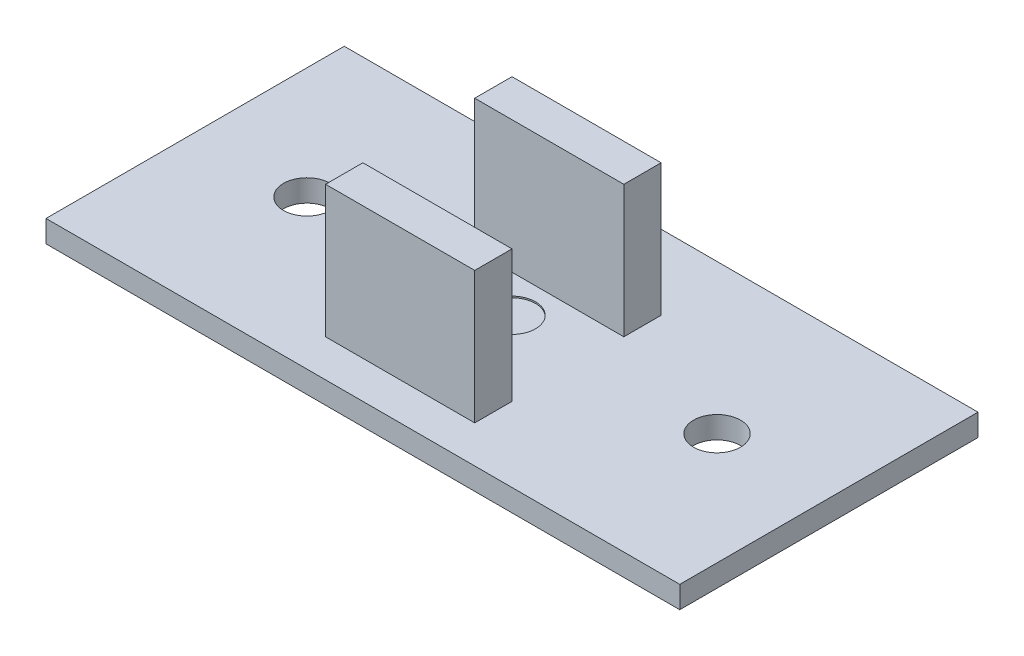
ISO-10303-21;
HEADER;
FILE_DESCRIPTION(('STEP AP214'),'2;1');
FILE_NAME('part.step','',(''),(''),'','','');
FILE_SCHEMA(('AUTOMOTIVE_DESIGN { 1 0 10303 214 1 1 1 1 }'));
ENDSEC;
DATA;
#1=APPLICATION_CONTEXT('core data for automotive mechanical design processes');
#2=APPLICATION_PROTOCOL_DEFINITION('international standard','automotive_design',2000,#1);
#3=PRODUCT_CONTEXT('',#1,'mechanical');
#4=PRODUCT('Part','Part','',(#3));
#5=PRODUCT_RELATED_PRODUCT_CATEGORY('part','',(#4));
#6=PRODUCT_DEFINITION_FORMATION('','',#4);
#7=PRODUCT_DEFINITION_CONTEXT('part definition',#1,'design');
#8=PRODUCT_DEFINITION('design','',#6,#7);
#9=PRODUCT_DEFINITION_SHAPE('','',#8);
#10=(LENGTH_UNIT() NAMED_UNIT(*) SI_UNIT(.MILLI.,.METRE.));
#11=(NAMED_UNIT(*) PLANE_ANGLE_UNIT() SI_UNIT($,.RADIAN.));
#12=(NAMED_UNIT(*) SI_UNIT($,.STERADIAN.) SOLID_ANGLE_UNIT());
#13=UNCERTAINTY_MEASURE_WITH_UNIT(LENGTH_MEASURE(1.E-05),#10,'distance_accuracy_value','');
#14=(GEOMETRIC_REPRESENTATION_CONTEXT(3) GLOBAL_UNCERTAINTY_ASSIGNED_CONTEXT((#13)) GLOBAL_UNIT_ASSIGNED_CONTEXT((#10,
#11,#12)) REPRESENTATION_CONTEXT('',''));
#15=CARTESIAN_POINT('',(0.,0.,0.));
#16=DIRECTION('',(0.,0.,1.));
#17=DIRECTION('',(1.,0.,0.));
#18=AXIS2_PLACEMENT_3D('',#15,#16,#17);
#19=CARTESIAN_POINT('',(16.51,10.5,-15.24));
#20=DIRECTION('',(0.,0.,1.));
#21=DIRECTION('',(1.,0.,0.));
#22=AXIS2_PLACEMENT_3D('',#19,#20,#21);
#23=PLANE('',#22);
#24=DIRECTION('',(-1.,0.,0.));
#25=VECTOR('',#24,1.);
#26=CARTESIAN_POINT('',(16.51,1.5,-15.24));
#27=LINE('',#26,#25);
#28=CARTESIAN_POINT('',(26.67,1.5,-15.24));
#29=VERTEX_POINT('',#28);
#30=CARTESIAN_POINT('',(16.51,1.5,-15.24));
#31=VERTEX_POINT('',#30);
#32=EDGE_CURVE('E118',#29,#31,#27,.T.);
#33=ORIENTED_EDGE('',*,*,#32,.T.);
#34=DIRECTION('',(0.,-1.,0.));
#35=VECTOR('',#34,1.);
#36=CARTESIAN_POINT('',(16.51,10.5,-15.24));
#37=LINE('',#36,#35);
#38=CARTESIAN_POINT('',(16.51,10.5,-15.24));
#39=VERTEX_POINT('',#38);
#40=EDGE_CURVE('E12',#39,#31,#37,.T.);
#41=ORIENTED_EDGE('',*,*,#40,.F.);
#42=DIRECTION('',(-1.,0.,0.));
#43=VECTOR('',#42,1.);
#44=CARTESIAN_POINT('',(16.51,10.5,-15.24));
#45=LINE('',#44,#43);
#46=CARTESIAN_POINT('',(26.67,10.5,-15.24));
#47=VERTEX_POINT('',#46);
#48=EDGE_CURVE('E106',#47,#39,#45,.T.);
#49=ORIENTED_EDGE('',*,*,#48,.F.);
#50=DIRECTION('',(0.,-1.,0.));
#51=VECTOR('',#50,1.);
#52=CARTESIAN_POINT('',(26.67,10.5,-15.24));
#53=LINE('',#52,#51);
#54=EDGE_CURVE('E114',#47,#29,#53,.T.);
#55=ORIENTED_EDGE('',*,*,#54,.T.);
#56=EDGE_LOOP('',(#33,#41,#49,#55));
#57=FACE_BOUND('',#56,.T.);
#58=ADVANCED_FACE('F55',(#57),#23,.F.);
#59=CARTESIAN_POINT('',(16.51,10.5,-15.24));
#60=DIRECTION('',(1.,0.,0.));
#61=DIRECTION('',(0.,0.,-1.));
#62=AXIS2_PLACEMENT_3D('',#59,#60,#61);
#63=PLANE('',#62);
#64=DIRECTION('',(0.,0.,1.));
#65=VECTOR('',#64,1.);
#66=CARTESIAN_POINT('',(16.51,1.5,-15.24));
#67=LINE('',#66,#65);
#68=CARTESIAN_POINT('',(16.51,1.5,-12.7));
#69=VERTEX_POINT('',#68);
#70=EDGE_CURVE('E110',#31,#69,#67,.T.);
#71=ORIENTED_EDGE('',*,*,#70,.T.);
#72=DIRECTION('',(0.,-1.,0.));
#73=VECTOR('',#72,1.);
#74=CARTESIAN_POINT('',(16.51,10.5,-12.7));
#75=LINE('',#74,#73);
#76=CARTESIAN_POINT('',(16.51,10.5,-12.7));
#77=VERTEX_POINT('',#76);
#78=EDGE_CURVE('E63',#77,#69,#75,.T.);
#79=ORIENTED_EDGE('',*,*,#78,.F.);
#80=DIRECTION('',(0.,0.,1.));
#81=VECTOR('',#80,1.);
#82=CARTESIAN_POINT('',(16.51,10.5,-15.24));
#83=LINE('',#82,#81);
#84=EDGE_CURVE('E101',#39,#77,#83,.T.);
#85=ORIENTED_EDGE('',*,*,#84,.F.);
#86=ORIENTED_EDGE('',*,*,#40,.T.);
#87=EDGE_LOOP('',(#71,#79,#85,#86));
#88=FACE_BOUND('',#87,.T.);
#89=ADVANCED_FACE('F109',(#88),#63,.F.);
#90=CARTESIAN_POINT('',(16.51,10.5,-12.7));
#91=DIRECTION('',(0.,0.,-1.));
#92=DIRECTION('',(-1.,0.,0.));
#93=AXIS2_PLACEMENT_3D('',#90,#91,#92);
#94=PLANE('',#93);
#95=DIRECTION('',(1.,0.,0.));
#96=VECTOR('',#95,1.);
#97=CARTESIAN_POINT('',(16.51,1.5,-12.7));
#98=LINE('',#97,#96);
#99=CARTESIAN_POINT('',(26.67,1.5,-12.7));
#100=VERTEX_POINT('',#99);
#101=EDGE_CURVE('E88',#69,#100,#98,.T.);
#102=ORIENTED_EDGE('',*,*,#101,.T.);
#103=DIRECTION('',(0.,-1.,0.));
#104=VECTOR('',#103,1.);
#105=CARTESIAN_POINT('',(26.67,10.5,-12.7));
#106=LINE('',#105,#104);
#107=CARTESIAN_POINT('',(26.67,10.5,-12.7));
#108=VERTEX_POINT('',#107);
#109=EDGE_CURVE('E111',#108,#100,#106,.T.);
#110=ORIENTED_EDGE('',*,*,#109,.F.);
#111=DIRECTION('',(1.,0.,0.));
#112=VECTOR('',#111,1.);
#113=CARTESIAN_POINT('',(16.51,10.5,-12.7));
#114=LINE('',#113,#112);
#115=EDGE_CURVE('E104',#77,#108,#114,.T.);
#116=ORIENTED_EDGE('',*,*,#115,.F.);
#117=ORIENTED_EDGE('',*,*,#78,.T.);
#118=EDGE_LOOP('',(#102,#110,#116,#117));
#119=FACE_BOUND('',#118,.T.);
#120=ADVANCED_FACE('F112',(#119),#94,.F.);
#121=CARTESIAN_POINT('',(26.67,10.5,-15.24));
#122=DIRECTION('',(-1.,0.,0.));
#123=DIRECTION('',(0.,0.,1.));
#124=AXIS2_PLACEMENT_3D('',#121,#122,#123);
#125=PLANE('',#124);
#126=DIRECTION('',(0.,0.,-1.));
#127=VECTOR('',#126,1.);
#128=CARTESIAN_POINT('',(26.67,1.5,-15.24));
#129=LINE('',#128,#127);
#130=EDGE_CURVE('E94',#100,#29,#129,.T.);
#131=ORIENTED_EDGE('',*,*,#130,.T.);
#132=ORIENTED_EDGE('',*,*,#54,.F.);
#133=DIRECTION('',(0.,0.,-1.));
#134=VECTOR('',#133,1.);
#135=CARTESIAN_POINT('',(26.67,10.5,-15.24));
#136=LINE('',#135,#134);
#137=EDGE_CURVE('E71',#108,#47,#136,.T.);
#138=ORIENTED_EDGE('',*,*,#137,.F.);
#139=ORIENTED_EDGE('',*,*,#109,.T.);
#140=EDGE_LOOP('',(#131,#132,#138,#139));
#141=FACE_BOUND('',#140,.T.);
#142=ADVANCED_FACE('F125',(#141),#125,.F.);
#143=CARTESIAN_POINT('',(0.,10.5,0.));
#144=DIRECTION('',(0.,-1.,0.));
#145=DIRECTION('',(0.,0.,-1.));
#146=AXIS2_PLACEMENT_3D('',#143,#144,#145);
#147=PLANE('',#146);
#148=ORIENTED_EDGE('',*,*,#48,.T.);
#149=ORIENTED_EDGE('',*,*,#84,.T.);
#150=ORIENTED_EDGE('',*,*,#115,.T.);
#151=ORIENTED_EDGE('',*,*,#137,.T.);
#152=EDGE_LOOP('',(#148,#149,#150,#151));
#153=FACE_BOUND('',#152,.T.);
#154=ADVANCED_FACE('F102',(#153),#147,.F.);
#155=CARTESIAN_POINT('',(0.,1.5,0.));
#156=DIRECTION('',(0.,-1.,0.));
#157=DIRECTION('',(0.,0.,-1.));
#158=AXIS2_PLACEMENT_3D('',#155,#156,#157);
#159=PLANE('',#158);
#160=ORIENTED_EDGE('',*,*,#32,.F.);
#161=ORIENTED_EDGE('',*,*,#130,.F.);
#162=ORIENTED_EDGE('',*,*,#101,.F.);
#163=ORIENTED_EDGE('',*,*,#70,.F.);
#164=EDGE_LOOP('',(#160,#161,#162,#163));
#165=FACE_BOUND('',#164,.T.);
#166=ADVANCED_FACE('F128',(#165),#159,.T.);
#167=CLOSED_SHELL('',(#58,#89,#120,#142,#154,#166));
#168=MANIFOLD_SOLID_BREP('B2',#167);
#169=CARTESIAN_POINT('',(16.51,10.5,-5.08));
#170=DIRECTION('',(1.,0.,0.));
#171=DIRECTION('',(0.,0.,-1.));
#172=AXIS2_PLACEMENT_3D('',#169,#170,#171);
#173=PLANE('',#172);
#174=DIRECTION('',(0.,0.,1.));
#175=VECTOR('',#174,1.);
#176=CARTESIAN_POINT('',(16.51,1.5,-5.08));
#177=LINE('',#176,#175);
#178=CARTESIAN_POINT('',(16.51,1.5,-5.08));
#179=VERTEX_POINT('',#178);
#180=CARTESIAN_POINT('',(16.51,1.5,-2.54));
#181=VERTEX_POINT('',#180);
#182=EDGE_CURVE('E250',#179,#181,#177,.T.);
#183=ORIENTED_EDGE('',*,*,#182,.T.);
#184=DIRECTION('',(0.,-1.,0.));
#185=VECTOR('',#184,1.);
#186=CARTESIAN_POINT('',(16.51,10.5,-2.54));
#187=LINE('',#186,#185);
#188=CARTESIAN_POINT('',(16.51,10.5,-2.54));
#189=VERTEX_POINT('',#188);
#190=EDGE_CURVE('E53',#189,#181,#187,.T.);
#191=ORIENTED_EDGE('',*,*,#190,.F.);
#192=DIRECTION('',(0.,0.,1.));
#193=VECTOR('',#192,1.);
#194=CARTESIAN_POINT('',(16.51,10.5,-5.08));
#195=LINE('',#194,#193);
#196=CARTESIAN_POINT('',(16.51,10.5,-5.08));
#197=VERTEX_POINT('',#196);
#198=EDGE_CURVE('E238',#197,#189,#195,.T.);
#199=ORIENTED_EDGE('',*,*,#198,.F.);
#200=DIRECTION('',(0.,-1.,0.));
#201=VECTOR('',#200,1.);
#202=CARTESIAN_POINT('',(16.51,10.5,-5.08));
#203=LINE('',#202,#201);
#204=EDGE_CURVE('E246',#197,#179,#203,.T.);
#205=ORIENTED_EDGE('',*,*,#204,.T.);
#206=EDGE_LOOP('',(#183,#191,#199,#205));
#207=FACE_BOUND('',#206,.T.);
#208=ADVANCED_FACE('F187',(#207),#173,.F.);
#209=CARTESIAN_POINT('',(16.51,10.5,-2.54));
#210=DIRECTION('',(0.,0.,-1.));
#211=DIRECTION('',(-1.,0.,0.));
#212=AXIS2_PLACEMENT_3D('',#209,#210,#211);
#213=PLANE('',#212);
#214=DIRECTION('',(1.,0.,0.));
#215=VECTOR('',#214,1.);
#216=CARTESIAN_POINT('',(16.51,1.5,-2.54));
#217=LINE('',#216,#215);
#218=CARTESIAN_POINT('',(26.67,1.5,-2.54));
#219=VERTEX_POINT('',#218);
#220=EDGE_CURVE('E242',#181,#219,#217,.T.);
#221=ORIENTED_EDGE('',*,*,#220,.T.);
#222=DIRECTION('',(0.,-1.,0.));
#223=VECTOR('',#222,1.);
#224=CARTESIAN_POINT('',(26.67,10.5,-2.54));
#225=LINE('',#224,#223);
#226=CARTESIAN_POINT('',(26.67,10.5,-2.54));
#227=VERTEX_POINT('',#226);
#228=EDGE_CURVE('E195',#227,#219,#225,.T.);
#229=ORIENTED_EDGE('',*,*,#228,.F.);
#230=DIRECTION('',(1.,0.,0.));
#231=VECTOR('',#230,1.);
#232=CARTESIAN_POINT('',(16.51,10.5,-2.54));
#233=LINE('',#232,#231);
#234=EDGE_CURVE('E233',#189,#227,#233,.T.);
#235=ORIENTED_EDGE('',*,*,#234,.F.);
#236=ORIENTED_EDGE('',*,*,#190,.T.);
#237=EDGE_LOOP('',(#221,#229,#235,#236));
#238=FACE_BOUND('',#237,.T.);
#239=ADVANCED_FACE('F241',(#238),#213,.F.);
#240=CARTESIAN_POINT('',(26.67,10.5,-5.08));
#241=DIRECTION('',(-1.,0.,0.));
#242=DIRECTION('',(0.,0.,1.));
#243=AXIS2_PLACEMENT_3D('',#240,#241,#242);
#244=PLANE('',#243);
#245=DIRECTION('',(0.,0.,-1.));
#246=VECTOR('',#245,1.);
#247=CARTESIAN_POINT('',(26.67,1.5,-5.08));
#248=LINE('',#247,#246);
#249=CARTESIAN_POINT('',(26.67,1.5,-5.08));
#250=VERTEX_POINT('',#249);
#251=EDGE_CURVE('E220',#219,#250,#248,.T.);
#252=ORIENTED_EDGE('',*,*,#251,.T.);
#253=DIRECTION('',(0.,-1.,0.));
#254=VECTOR('',#253,1.);
#255=CARTESIAN_POINT('',(26.67,10.5,-5.08));
#256=LINE('',#255,#254);
#257=CARTESIAN_POINT('',(26.67,10.5,-5.08));
#258=VERTEX_POINT('',#257);
#259=EDGE_CURVE('E243',#258,#250,#256,.T.);
#260=ORIENTED_EDGE('',*,*,#259,.F.);
#261=DIRECTION('',(0.,0.,-1.));
#262=VECTOR('',#261,1.);
#263=CARTESIAN_POINT('',(26.67,10.5,-5.08));
#264=LINE('',#263,#262);
#265=EDGE_CURVE('E236',#227,#258,#264,.T.);
#266=ORIENTED_EDGE('',*,*,#265,.F.);
#267=ORIENTED_EDGE('',*,*,#228,.T.);
#268=EDGE_LOOP('',(#252,#260,#266,#267));
#269=FACE_BOUND('',#268,.T.);
#270=ADVANCED_FACE('F244',(#269),#244,.F.);
#271=CARTESIAN_POINT('',(16.51,10.5,-5.08));
#272=DIRECTION('',(0.,0.,1.));
#273=DIRECTION('',(1.,0.,0.));
#274=AXIS2_PLACEMENT_3D('',#271,#272,#273);
#275=PLANE('',#274);
#276=DIRECTION('',(-1.,0.,0.));
#277=VECTOR('',#276,1.);
#278=CARTESIAN_POINT('',(16.51,1.5,-5.08));
#279=LINE('',#278,#277);
#280=EDGE_CURVE('E226',#250,#179,#279,.T.);
#281=ORIENTED_EDGE('',*,*,#280,.T.);
#282=ORIENTED_EDGE('',*,*,#204,.F.);
#283=DIRECTION('',(-1.,0.,0.));
#284=VECTOR('',#283,1.);
#285=CARTESIAN_POINT('',(16.51,10.5,-5.08));
#286=LINE('',#285,#284);
#287=EDGE_CURVE('E203',#258,#197,#286,.T.);
#288=ORIENTED_EDGE('',*,*,#287,.F.);
#289=ORIENTED_EDGE('',*,*,#259,.T.);
#290=EDGE_LOOP('',(#281,#282,#288,#289));
#291=FACE_BOUND('',#290,.T.);
#292=ADVANCED_FACE('F257',(#291),#275,.F.);
#293=CARTESIAN_POINT('',(0.,10.5,0.));
#294=DIRECTION('',(0.,1.,0.));
#295=DIRECTION('',(0.,0.,1.));
#296=AXIS2_PLACEMENT_3D('',#293,#294,#295);
#297=PLANE('',#296);
#298=ORIENTED_EDGE('',*,*,#198,.T.);
#299=ORIENTED_EDGE('',*,*,#234,.T.);
#300=ORIENTED_EDGE('',*,*,#265,.T.);
#301=ORIENTED_EDGE('',*,*,#287,.T.);
#302=EDGE_LOOP('',(#298,#299,#300,#301));
#303=FACE_BOUND('',#302,.T.);
#304=ADVANCED_FACE('F234',(#303),#297,.T.);
#305=CARTESIAN_POINT('',(0.,1.5,0.));
#306=DIRECTION('',(0.,1.,0.));
#307=DIRECTION('',(0.,0.,1.));
#308=AXIS2_PLACEMENT_3D('',#305,#306,#307);
#309=PLANE('',#308);
#310=ORIENTED_EDGE('',*,*,#182,.F.);
#311=ORIENTED_EDGE('',*,*,#280,.F.);
#312=ORIENTED_EDGE('',*,*,#251,.F.);
#313=ORIENTED_EDGE('',*,*,#220,.F.);
#314=EDGE_LOOP('',(#310,#311,#312,#313));
#315=FACE_BOUND('',#314,.T.);
#316=ADVANCED_FACE('F260',(#315),#309,.F.);
#317=CLOSED_SHELL('',(#208,#239,#270,#292,#304,#316));
#318=MANIFOLD_SOLID_BREP('B6',#317);
#319=CARTESIAN_POINT('',(0.,1.5,0.));
#320=DIRECTION('',(0.,-1.,0.));
#321=DIRECTION('',(0.,0.,-1.));
#322=AXIS2_PLACEMENT_3D('',#319,#320,#321);
#323=PLANE('',#322);
#324=CARTESIAN_POINT('',(21.59,1.5,-10.16));
#325=DIRECTION('',(0.,1.,0.));
#326=DIRECTION('',(0.,0.,1.));
#327=AXIS2_PLACEMENT_3D('',#324,#325,#326);
#328=CIRCLE('',#327,1.6);
#329=CARTESIAN_POINT('',(21.59,1.5,-8.56));
#330=VERTEX_POINT('',#329);
#331=EDGE_CURVE('E402',#330,#330,#328,.T.);
#332=ORIENTED_EDGE('',*,*,#331,.F.);
#333=EDGE_LOOP('',(#332));
#334=FACE_BOUND('',#333,.T.);
#335=DIRECTION('',(0.,0.,1.));
#336=VECTOR('',#335,1.);
#337=CARTESIAN_POINT('',(0.,1.5,0.));
#338=LINE('',#337,#336);
#339=CARTESIAN_POINT('',(0.,1.5,-20.32));
#340=VERTEX_POINT('',#339);
#341=CARTESIAN_POINT('',(0.,1.5,0.));
#342=VERTEX_POINT('',#341);
#343=EDGE_CURVE('E363',#340,#342,#338,.T.);
#344=ORIENTED_EDGE('',*,*,#343,.T.);
#345=DIRECTION('',(1.,0.,0.));
#346=VECTOR('',#345,1.);
#347=CARTESIAN_POINT('',(0.,1.5,0.));
#348=LINE('',#347,#346);
#349=CARTESIAN_POINT('',(43.18,1.5,0.));
#350=VERTEX_POINT('',#349);
#351=EDGE_CURVE('E358',#342,#350,#348,.T.);
#352=ORIENTED_EDGE('',*,*,#351,.T.);
#353=DIRECTION('',(0.,0.,-1.));
#354=VECTOR('',#353,1.);
#355=CARTESIAN_POINT('',(43.18,1.5,0.));
#356=LINE('',#355,#354);
#357=CARTESIAN_POINT('',(43.18,1.5,-20.32));
#358=VERTEX_POINT('',#357);
#359=EDGE_CURVE('E361',#350,#358,#356,.T.);
#360=ORIENTED_EDGE('',*,*,#359,.T.);
#361=DIRECTION('',(-1.,0.,0.));
#362=VECTOR('',#361,1.);
#363=CARTESIAN_POINT('',(0.,1.5,-20.32));
#364=LINE('',#363,#362);
#365=EDGE_CURVE('E328',#358,#340,#364,.T.);
#366=ORIENTED_EDGE('',*,*,#365,.T.);
#367=EDGE_LOOP('',(#344,#352,#360,#366));
#368=FACE_BOUND('',#367,.T.);
#369=CARTESIAN_POINT('',(7.62,1.5,-10.16));
#370=DIRECTION('',(0.,1.,0.));
#371=DIRECTION('',(0.,0.,1.));
#372=AXIS2_PLACEMENT_3D('',#369,#370,#371);
#373=CIRCLE('',#372,1.6);
#374=CARTESIAN_POINT('',(7.62,1.5,-8.56));
#375=VERTEX_POINT('',#374);
#376=EDGE_CURVE('E378',#375,#375,#373,.T.);
#377=ORIENTED_EDGE('',*,*,#376,.F.);
#378=EDGE_LOOP('',(#377));
#379=FACE_BOUND('',#378,.T.);
#380=CARTESIAN_POINT('',(35.56,1.5,-10.16));
#381=DIRECTION('',(0.,1.,0.));
#382=DIRECTION('',(0.,0.,-1.));
#383=AXIS2_PLACEMENT_3D('',#380,#381,#382);
#384=CIRCLE('',#383,1.6);
#385=CARTESIAN_POINT('',(35.56,1.5,-11.76));
#386=VERTEX_POINT('',#385);
#387=EDGE_CURVE('E393',#386,#386,#384,.T.);
#388=ORIENTED_EDGE('',*,*,#387,.F.);
#389=EDGE_LOOP('',(#388));
#390=FACE_BOUND('',#389,.T.);
#391=ADVANCED_FACE('F311',(#334,#368,#379,#390),#323,.F.);
#392=CARTESIAN_POINT('',(0.,0.,0.));
#393=DIRECTION('',(0.,-1.,0.));
#394=DIRECTION('',(0.,0.,-1.));
#395=AXIS2_PLACEMENT_3D('',#392,#393,#394);
#396=PLANE('',#395);
#397=CARTESIAN_POINT('',(7.62,0.,-10.16));
#398=DIRECTION('',(0.,1.,0.));
#399=DIRECTION('',(0.,0.,1.));
#400=AXIS2_PLACEMENT_3D('',#397,#398,#399);
#401=CIRCLE('',#400,1.6);
#402=CARTESIAN_POINT('',(7.62,0.,-8.56));
#403=VERTEX_POINT('',#402);
#404=EDGE_CURVE('E390',#403,#403,#401,.T.);
#405=ORIENTED_EDGE('',*,*,#404,.T.);
#406=EDGE_LOOP('',(#405));
#407=FACE_BOUND('',#406,.T.);
#408=DIRECTION('',(0.,0.,1.));
#409=VECTOR('',#408,1.);
#410=CARTESIAN_POINT('',(0.,0.,0.));
#411=LINE('',#410,#409);
#412=CARTESIAN_POINT('',(0.,0.,-20.32));
#413=VERTEX_POINT('',#412);
#414=CARTESIAN_POINT('',(0.,0.,0.));
#415=VERTEX_POINT('',#414);
#416=EDGE_CURVE('E375',#413,#415,#411,.T.);
#417=ORIENTED_EDGE('',*,*,#416,.F.);
#418=DIRECTION('',(-1.,0.,0.));
#419=VECTOR('',#418,1.);
#420=CARTESIAN_POINT('',(0.,0.,-20.32));
#421=LINE('',#420,#419);
#422=CARTESIAN_POINT('',(43.18,0.,-20.32));
#423=VERTEX_POINT('',#422);
#424=EDGE_CURVE('E351',#423,#413,#421,.T.);
#425=ORIENTED_EDGE('',*,*,#424,.F.);
#426=DIRECTION('',(0.,0.,-1.));
#427=VECTOR('',#426,1.);
#428=CARTESIAN_POINT('',(43.18,0.,0.));
#429=LINE('',#428,#427);
#430=CARTESIAN_POINT('',(43.18,0.,0.));
#431=VERTEX_POINT('',#430);
#432=EDGE_CURVE('E345',#431,#423,#429,.T.);
#433=ORIENTED_EDGE('',*,*,#432,.F.);
#434=DIRECTION('',(1.,0.,0.));
#435=VECTOR('',#434,1.);
#436=CARTESIAN_POINT('',(0.,0.,0.));
#437=LINE('',#436,#435);
#438=EDGE_CURVE('E367',#415,#431,#437,.T.);
#439=ORIENTED_EDGE('',*,*,#438,.F.);
#440=EDGE_LOOP('',(#417,#425,#433,#439));
#441=FACE_BOUND('',#440,.T.);
#442=CARTESIAN_POINT('',(35.56,0.,-10.16));
#443=DIRECTION('',(0.,1.,0.));
#444=DIRECTION('',(0.,0.,-1.));
#445=AXIS2_PLACEMENT_3D('',#442,#443,#444);
#446=CIRCLE('',#445,1.6);
#447=CARTESIAN_POINT('',(35.56,0.,-11.76));
#448=VERTEX_POINT('',#447);
#449=EDGE_CURVE('E396',#448,#448,#446,.T.);
#450=ORIENTED_EDGE('',*,*,#449,.T.);
#451=EDGE_LOOP('',(#450));
#452=FACE_BOUND('',#451,.T.);
#453=ADVANCED_FACE('F386',(#407,#441,#452),#396,.T.);
#454=CARTESIAN_POINT('',(0.,1.5,0.));
#455=DIRECTION('',(1.,0.,0.));
#456=DIRECTION('',(0.,0.,-1.));
#457=AXIS2_PLACEMENT_3D('',#454,#455,#456);
#458=PLANE('',#457);
#459=ORIENTED_EDGE('',*,*,#416,.T.);
#460=DIRECTION('',(0.,-1.,0.));
#461=VECTOR('',#460,1.);
#462=CARTESIAN_POINT('',(0.,1.5,0.));
#463=LINE('',#462,#461);
#464=EDGE_CURVE('E185',#342,#415,#463,.T.);
#465=ORIENTED_EDGE('',*,*,#464,.F.);
#466=ORIENTED_EDGE('',*,*,#343,.F.);
#467=DIRECTION('',(0.,-1.,0.));
#468=VECTOR('',#467,1.);
#469=CARTESIAN_POINT('',(0.,1.5,-20.32));
#470=LINE('',#469,#468);
#471=EDGE_CURVE('E371',#340,#413,#470,.T.);
#472=ORIENTED_EDGE('',*,*,#471,.T.);
#473=EDGE_LOOP('',(#459,#465,#466,#472));
#474=FACE_BOUND('',#473,.T.);
#475=ADVANCED_FACE('F313',(#474),#458,.F.);
#476=CARTESIAN_POINT('',(0.,1.5,0.));
#477=DIRECTION('',(0.,0.,-1.));
#478=DIRECTION('',(-1.,0.,0.));
#479=AXIS2_PLACEMENT_3D('',#476,#477,#478);
#480=PLANE('',#479);
#481=ORIENTED_EDGE('',*,*,#438,.T.);
#482=DIRECTION('',(0.,-1.,0.));
#483=VECTOR('',#482,1.);
#484=CARTESIAN_POINT('',(43.18,1.5,0.));
#485=LINE('',#484,#483);
#486=EDGE_CURVE('E320',#350,#431,#485,.T.);
#487=ORIENTED_EDGE('',*,*,#486,.F.);
#488=ORIENTED_EDGE('',*,*,#351,.F.);
#489=ORIENTED_EDGE('',*,*,#464,.T.);
#490=EDGE_LOOP('',(#481,#487,#488,#489));
#491=FACE_BOUND('',#490,.T.);
#492=ADVANCED_FACE('F366',(#491),#480,.F.);
#493=CARTESIAN_POINT('',(43.18,1.5,0.));
#494=DIRECTION('',(-1.,0.,0.));
#495=DIRECTION('',(0.,0.,1.));
#496=AXIS2_PLACEMENT_3D('',#493,#494,#495);
#497=PLANE('',#496);
#498=ORIENTED_EDGE('',*,*,#432,.T.);
#499=DIRECTION('',(0.,-1.,0.));
#500=VECTOR('',#499,1.);
#501=CARTESIAN_POINT('',(43.18,1.5,-20.32));
#502=LINE('',#501,#500);
#503=EDGE_CURVE('E368',#358,#423,#502,.T.);
#504=ORIENTED_EDGE('',*,*,#503,.F.);
#505=ORIENTED_EDGE('',*,*,#359,.F.);
#506=ORIENTED_EDGE('',*,*,#486,.T.);
#507=EDGE_LOOP('',(#498,#504,#505,#506));
#508=FACE_BOUND('',#507,.T.);
#509=ADVANCED_FACE('F369',(#508),#497,.F.);
#510=CARTESIAN_POINT('',(0.,1.5,-20.32));
#511=DIRECTION('',(0.,0.,1.));
#512=DIRECTION('',(1.,0.,0.));
#513=AXIS2_PLACEMENT_3D('',#510,#511,#512);
#514=PLANE('',#513);
#515=ORIENTED_EDGE('',*,*,#424,.T.);
#516=ORIENTED_EDGE('',*,*,#471,.F.);
#517=ORIENTED_EDGE('',*,*,#365,.F.);
#518=ORIENTED_EDGE('',*,*,#503,.T.);
#519=EDGE_LOOP('',(#515,#516,#517,#518));
#520=FACE_BOUND('',#519,.T.);
#521=ADVANCED_FACE('F383',(#520),#514,.F.);
#522=CARTESIAN_POINT('',(7.62,1.5,-10.16));
#523=DIRECTION('',(0.,-1.,0.));
#524=DIRECTION('',(0.,0.,-1.));
#525=AXIS2_PLACEMENT_3D('',#522,#523,#524);
#526=CYLINDRICAL_SURFACE('',#525,1.6);
#527=ORIENTED_EDGE('',*,*,#376,.T.);
#528=EDGE_LOOP('',(#527));
#529=FACE_BOUND('',#528,.T.);
#530=ORIENTED_EDGE('',*,*,#404,.F.);
#531=EDGE_LOOP('',(#530));
#532=FACE_BOUND('',#531,.T.);
#533=ADVANCED_FACE('F427',(#529,#532),#526,.F.);
#534=CARTESIAN_POINT('',(35.56,1.5,-10.16));
#535=DIRECTION('',(0.,-1.,0.));
#536=DIRECTION('',(0.,0.,-1.));
#537=AXIS2_PLACEMENT_3D('',#534,#535,#536);
#538=CYLINDRICAL_SURFACE('',#537,1.6);
#539=ORIENTED_EDGE('',*,*,#387,.T.);
#540=EDGE_LOOP('',(#539));
#541=FACE_BOUND('',#540,.T.);
#542=ORIENTED_EDGE('',*,*,#449,.F.);
#543=EDGE_LOOP('',(#542));
#544=FACE_BOUND('',#543,.T.);
#545=ADVANCED_FACE('F413',(#541,#544),#538,.F.);
#546=CARTESIAN_POINT('',(21.59,1.4,-10.16));
#547=DIRECTION('',(0.,1.,0.));
#548=DIRECTION('',(0.,0.,1.));
#549=AXIS2_PLACEMENT_3D('',#546,#547,#548);
#550=CYLINDRICAL_SURFACE('',#549,1.6);
#551=CARTESIAN_POINT('',(21.59,1.4,-10.16));
#552=DIRECTION('',(0.,1.,0.));
#553=DIRECTION('',(0.,0.,1.));
#554=AXIS2_PLACEMENT_3D('',#551,#552,#553);
#555=CIRCLE('',#554,1.6);
#556=CARTESIAN_POINT('',(21.59,1.4,-8.56));
#557=VERTEX_POINT('',#556);
#558=EDGE_CURVE('E399',#557,#557,#555,.T.);
#559=ORIENTED_EDGE('',*,*,#558,.F.);
#560=EDGE_LOOP('',(#559));
#561=FACE_BOUND('',#560,.T.);
#562=ORIENTED_EDGE('',*,*,#331,.T.);
#563=EDGE_LOOP('',(#562));
#564=FACE_BOUND('',#563,.T.);
#565=ADVANCED_FACE('F410',(#561,#564),#550,.F.);
#566=CARTESIAN_POINT('',(21.59,1.4,-10.16));
#567=DIRECTION('',(0.,1.,0.));
#568=DIRECTION('',(0.,0.,1.));
#569=AXIS2_PLACEMENT_3D('',#566,#567,#568);
#570=PLANE('',#569);
#571=ORIENTED_EDGE('',*,*,#558,.T.);
#572=EDGE_LOOP('',(#571));
#573=FACE_BOUND('',#572,.T.);
#574=ADVANCED_FACE('F408',(#573),#570,.T.);
#575=CLOSED_SHELL('',(#391,#453,#475,#492,#509,#521,#533,#545,#565,#574));
#576=MANIFOLD_SOLID_BREP('B47',#575);
#577=ADVANCED_BREP_SHAPE_REPRESENTATION('',(#18,#168,#318,#576),#14);
#578=SHAPE_DEFINITION_REPRESENTATION(#9,#577);
ENDSEC;
END-ISO-10303-21;
